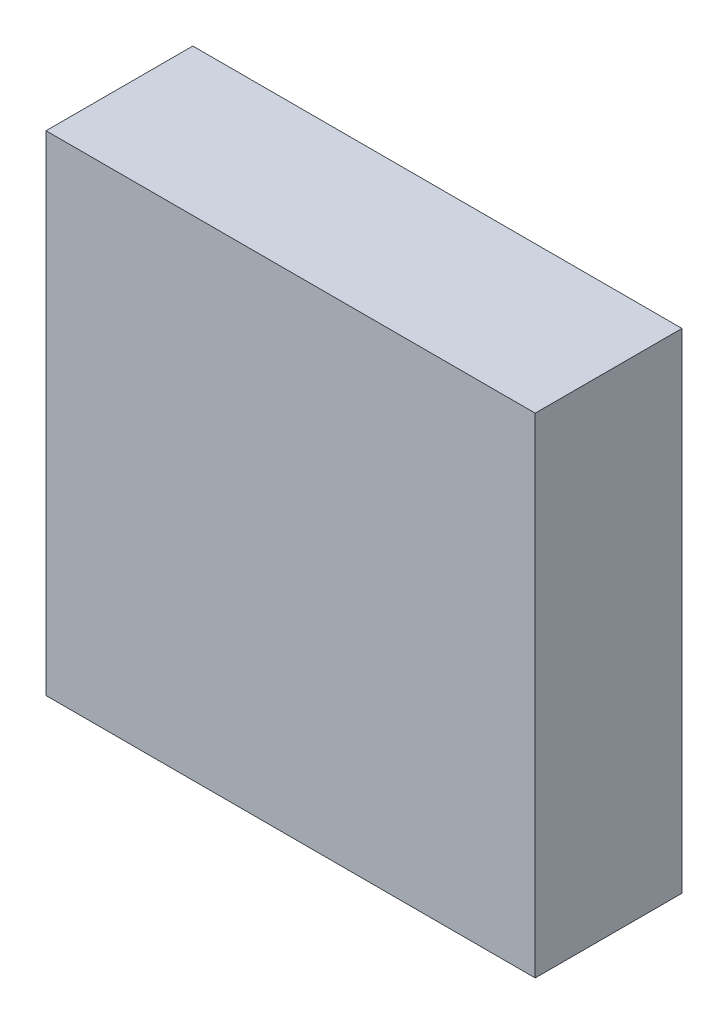
ISO-10303-21;
HEADER;
FILE_DESCRIPTION(('STEP AP214'),'2;1');
FILE_NAME('part.step','',(''),(''),'','','');
FILE_SCHEMA(('AUTOMOTIVE_DESIGN { 1 0 10303 214 1 1 1 1 }'));
ENDSEC;
DATA;
#1=APPLICATION_CONTEXT('core data for automotive mechanical design processes');
#2=APPLICATION_PROTOCOL_DEFINITION('international standard','automotive_design',2000,#1);
#3=PRODUCT_CONTEXT('',#1,'mechanical');
#4=PRODUCT('Part','Part','',(#3));
#5=PRODUCT_RELATED_PRODUCT_CATEGORY('part','',(#4));
#6=PRODUCT_DEFINITION_FORMATION('','',#4);
#7=PRODUCT_DEFINITION_CONTEXT('part definition',#1,'design');
#8=PRODUCT_DEFINITION('design','',#6,#7);
#9=PRODUCT_DEFINITION_SHAPE('','',#8);
#10=(LENGTH_UNIT() NAMED_UNIT(*) SI_UNIT(.MILLI.,.METRE.));
#11=(NAMED_UNIT(*) PLANE_ANGLE_UNIT() SI_UNIT($,.RADIAN.));
#12=(NAMED_UNIT(*) SI_UNIT($,.STERADIAN.) SOLID_ANGLE_UNIT());
#13=UNCERTAINTY_MEASURE_WITH_UNIT(LENGTH_MEASURE(1.E-05),#10,'distance_accuracy_value','');
#14=(GEOMETRIC_REPRESENTATION_CONTEXT(3) GLOBAL_UNCERTAINTY_ASSIGNED_CONTEXT((#13)) GLOBAL_UNIT_ASSIGNED_CONTEXT((#10,
#11,#12)) REPRESENTATION_CONTEXT('',''));
#15=CARTESIAN_POINT('',(0.,0.,0.));
#16=DIRECTION('',(0.,0.,1.));
#17=DIRECTION('',(1.,0.,0.));
#18=AXIS2_PLACEMENT_3D('',#15,#16,#17);
#19=CARTESIAN_POINT('',(50.,50.,30.));
#20=DIRECTION('',(-1.,0.,0.));
#21=DIRECTION('',(0.,-1.,0.));
#22=AXIS2_PLACEMENT_3D('',#19,#20,#21);
#23=PLANE('',#22);
#24=DIRECTION('',(0.,1.,0.));
#25=VECTOR('',#24,1.);
#26=CARTESIAN_POINT('',(50.,50.,0.));
#27=LINE('',#26,#25);
#28=CARTESIAN_POINT('',(50.,-50.,0.));
#29=VERTEX_POINT('',#28);
#30=CARTESIAN_POINT('',(50.,50.,0.));
#31=VERTEX_POINT('',#30);
#32=EDGE_CURVE('E96',#29,#31,#27,.T.);
#33=ORIENTED_EDGE('',*,*,#32,.T.);
#34=DIRECTION('',(0.,0.,-1.));
#35=VECTOR('',#34,1.);
#36=CARTESIAN_POINT('',(50.,50.,30.));
#37=LINE('',#36,#35);
#38=CARTESIAN_POINT('',(50.,50.,30.));
#39=VERTEX_POINT('',#38);
#40=EDGE_CURVE('E11',#39,#31,#37,.T.);
#41=ORIENTED_EDGE('',*,*,#40,.F.);
#42=DIRECTION('',(0.,1.,0.));
#43=VECTOR('',#42,1.);
#44=CARTESIAN_POINT('',(50.,50.,30.));
#45=LINE('',#44,#43);
#46=CARTESIAN_POINT('',(50.,-50.,30.));
#47=VERTEX_POINT('',#46);
#48=EDGE_CURVE('E84',#47,#39,#45,.T.);
#49=ORIENTED_EDGE('',*,*,#48,.F.);
#50=DIRECTION('',(0.,0.,-1.));
#51=VECTOR('',#50,1.);
#52=CARTESIAN_POINT('',(50.,-50.,30.));
#53=LINE('',#52,#51);
#54=EDGE_CURVE('E92',#47,#29,#53,.T.);
#55=ORIENTED_EDGE('',*,*,#54,.T.);
#56=EDGE_LOOP('',(#33,#41,#49,#55));
#57=FACE_BOUND('',#56,.T.);
#58=ADVANCED_FACE('F33',(#57),#23,.F.);
#59=CARTESIAN_POINT('',(-50.,50.,30.));
#60=DIRECTION('',(0.,-1.,0.));
#61=DIRECTION('',(1.,0.,0.));
#62=AXIS2_PLACEMENT_3D('',#59,#60,#61);
#63=PLANE('',#62);
#64=DIRECTION('',(-1.,0.,0.));
#65=VECTOR('',#64,1.);
#66=CARTESIAN_POINT('',(-50.,50.,0.));
#67=LINE('',#66,#65);
#68=CARTESIAN_POINT('',(-50.,50.,0.));
#69=VERTEX_POINT('',#68);
#70=EDGE_CURVE('E88',#31,#69,#67,.T.);
#71=ORIENTED_EDGE('',*,*,#70,.T.);
#72=DIRECTION('',(0.,0.,-1.));
#73=VECTOR('',#72,1.);
#74=CARTESIAN_POINT('',(-50.,50.,30.));
#75=LINE('',#74,#73);
#76=CARTESIAN_POINT('',(-50.,50.,30.));
#77=VERTEX_POINT('',#76);
#78=EDGE_CURVE('E41',#77,#69,#75,.T.);
#79=ORIENTED_EDGE('',*,*,#78,.F.);
#80=DIRECTION('',(-1.,0.,0.));
#81=VECTOR('',#80,1.);
#82=CARTESIAN_POINT('',(-50.,50.,30.));
#83=LINE('',#82,#81);
#84=EDGE_CURVE('E79',#39,#77,#83,.T.);
#85=ORIENTED_EDGE('',*,*,#84,.F.);
#86=ORIENTED_EDGE('',*,*,#40,.T.);
#87=EDGE_LOOP('',(#71,#79,#85,#86));
#88=FACE_BOUND('',#87,.T.);
#89=ADVANCED_FACE('F87',(#88),#63,.F.);
#90=CARTESIAN_POINT('',(-50.,50.,30.));
#91=DIRECTION('',(1.,0.,0.));
#92=DIRECTION('',(0.,0.,-1.));
#93=AXIS2_PLACEMENT_3D('',#90,#91,#92);
#94=PLANE('',#93);
#95=DIRECTION('',(0.,-1.,0.));
#96=VECTOR('',#95,1.);
#97=CARTESIAN_POINT('',(-50.,50.,0.));
#98=LINE('',#97,#96);
#99=CARTESIAN_POINT('',(-50.,-50.,0.));
#100=VERTEX_POINT('',#99);
#101=EDGE_CURVE('E66',#69,#100,#98,.T.);
#102=ORIENTED_EDGE('',*,*,#101,.T.);
#103=DIRECTION('',(0.,0.,-1.));
#104=VECTOR('',#103,1.);
#105=CARTESIAN_POINT('',(-50.,-50.,30.));
#106=LINE('',#105,#104);
#107=CARTESIAN_POINT('',(-50.,-50.,30.));
#108=VERTEX_POINT('',#107);
#109=EDGE_CURVE('E89',#108,#100,#106,.T.);
#110=ORIENTED_EDGE('',*,*,#109,.F.);
#111=DIRECTION('',(0.,-1.,0.));
#112=VECTOR('',#111,1.);
#113=CARTESIAN_POINT('',(-50.,50.,30.));
#114=LINE('',#113,#112);
#115=EDGE_CURVE('E82',#77,#108,#114,.T.);
#116=ORIENTED_EDGE('',*,*,#115,.F.);
#117=ORIENTED_EDGE('',*,*,#78,.T.);
#118=EDGE_LOOP('',(#102,#110,#116,#117));
#119=FACE_BOUND('',#118,.T.);
#120=ADVANCED_FACE('F90',(#119),#94,.F.);
#121=CARTESIAN_POINT('',(-50.,-50.,30.));
#122=DIRECTION('',(0.,1.,0.));
#123=DIRECTION('',(-1.,0.,0.));
#124=AXIS2_PLACEMENT_3D('',#121,#122,#123);
#125=PLANE('',#124);
#126=DIRECTION('',(1.,0.,0.));
#127=VECTOR('',#126,1.);
#128=CARTESIAN_POINT('',(-50.,-50.,0.));
#129=LINE('',#128,#127);
#130=EDGE_CURVE('E72',#100,#29,#129,.T.);
#131=ORIENTED_EDGE('',*,*,#130,.T.);
#132=ORIENTED_EDGE('',*,*,#54,.F.);
#133=DIRECTION('',(1.,0.,0.));
#134=VECTOR('',#133,1.);
#135=CARTESIAN_POINT('',(-50.,-50.,30.));
#136=LINE('',#135,#134);
#137=EDGE_CURVE('E49',#108,#47,#136,.T.);
#138=ORIENTED_EDGE('',*,*,#137,.F.);
#139=ORIENTED_EDGE('',*,*,#109,.T.);
#140=EDGE_LOOP('',(#131,#132,#138,#139));
#141=FACE_BOUND('',#140,.T.);
#142=ADVANCED_FACE('F103',(#141),#125,.F.);
#143=CARTESIAN_POINT('',(0.,0.,30.));
#144=DIRECTION('',(0.,0.,1.));
#145=DIRECTION('',(1.,0.,0.));
#146=AXIS2_PLACEMENT_3D('',#143,#144,#145);
#147=PLANE('',#146);
#148=ORIENTED_EDGE('',*,*,#48,.T.);
#149=ORIENTED_EDGE('',*,*,#84,.T.);
#150=ORIENTED_EDGE('',*,*,#115,.T.);
#151=ORIENTED_EDGE('',*,*,#137,.T.);
#152=EDGE_LOOP('',(#148,#149,#150,#151));
#153=FACE_BOUND('',#152,.T.);
#154=ADVANCED_FACE('F80',(#153),#147,.T.);
#155=CARTESIAN_POINT('',(0.,0.,0.));
#156=DIRECTION('',(0.,0.,1.));
#157=DIRECTION('',(1.,0.,0.));
#158=AXIS2_PLACEMENT_3D('',#155,#156,#157);
#159=PLANE('',#158);
#160=ORIENTED_EDGE('',*,*,#32,.F.);
#161=ORIENTED_EDGE('',*,*,#130,.F.);
#162=ORIENTED_EDGE('',*,*,#101,.F.);
#163=ORIENTED_EDGE('',*,*,#70,.F.);
#164=EDGE_LOOP('',(#160,#161,#162,#163));
#165=FACE_BOUND('',#164,.T.);
#166=ADVANCED_FACE('F106',(#165),#159,.F.);
#167=CLOSED_SHELL('',(#58,#89,#120,#142,#154,#166));
#168=MANIFOLD_SOLID_BREP('B2',#167);
#169=ADVANCED_BREP_SHAPE_REPRESENTATION('',(#18,#168),#14);
#170=SHAPE_DEFINITION_REPRESENTATION(#9,#169);
ENDSEC;
END-ISO-10303-21;
